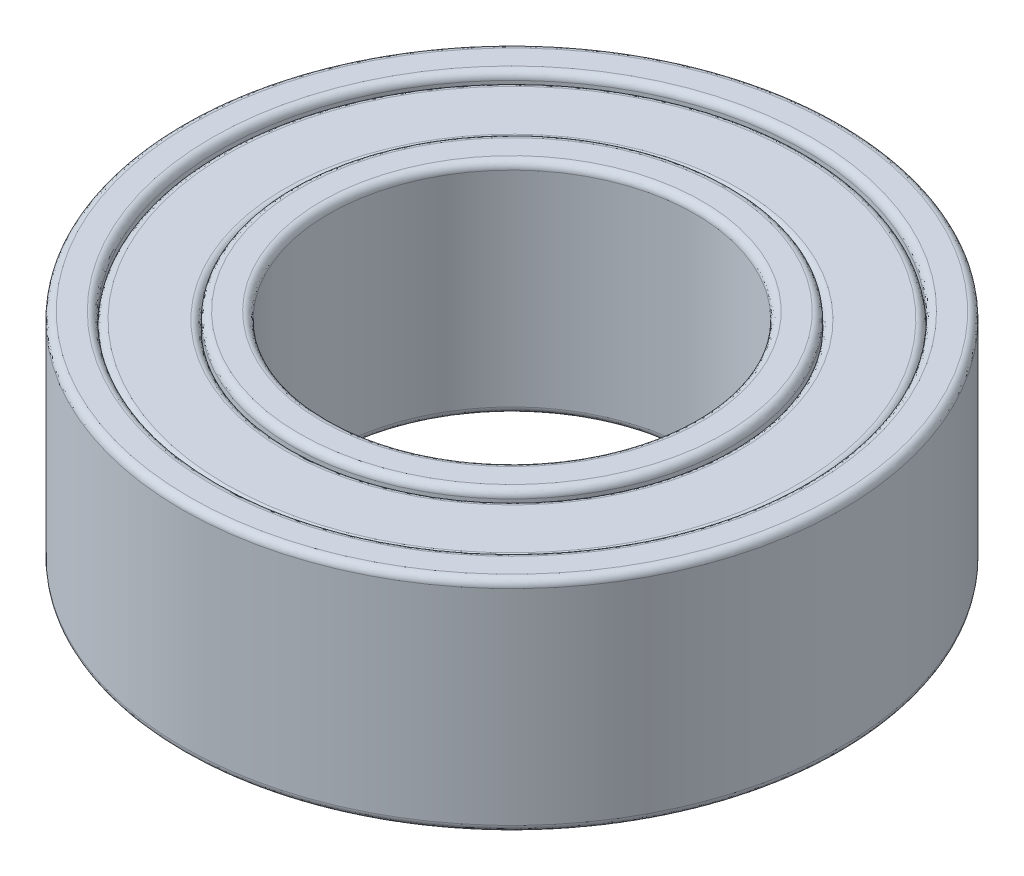
ISO-10303-21;
HEADER;
FILE_DESCRIPTION(('STEP AP214'),'2;1');
FILE_NAME('part.step','',(''),(''),'','','');
FILE_SCHEMA(('AUTOMOTIVE_DESIGN { 1 0 10303 214 1 1 1 1 }'));
ENDSEC;
DATA;
#1=APPLICATION_CONTEXT('core data for automotive mechanical design processes');
#2=APPLICATION_PROTOCOL_DEFINITION('international standard','automotive_design',2000,#1);
#3=PRODUCT_CONTEXT('',#1,'mechanical');
#4=PRODUCT('Part','Part','',(#3));
#5=PRODUCT_RELATED_PRODUCT_CATEGORY('part','',(#4));
#6=PRODUCT_DEFINITION_FORMATION('','',#4);
#7=PRODUCT_DEFINITION_CONTEXT('part definition',#1,'design');
#8=PRODUCT_DEFINITION('design','',#6,#7);
#9=PRODUCT_DEFINITION_SHAPE('','',#8);
#10=(LENGTH_UNIT() NAMED_UNIT(*) SI_UNIT(.MILLI.,.METRE.));
#11=(NAMED_UNIT(*) PLANE_ANGLE_UNIT() SI_UNIT($,.RADIAN.));
#12=(NAMED_UNIT(*) SI_UNIT($,.STERADIAN.) SOLID_ANGLE_UNIT());
#13=UNCERTAINTY_MEASURE_WITH_UNIT(LENGTH_MEASURE(1.E-05),#10,'distance_accuracy_value','');
#14=(GEOMETRIC_REPRESENTATION_CONTEXT(3) GLOBAL_UNCERTAINTY_ASSIGNED_CONTEXT((#13)) GLOBAL_UNIT_ASSIGNED_CONTEXT((#10,
#11,#12)) REPRESENTATION_CONTEXT('',''));
#15=CARTESIAN_POINT('',(0.,0.,0.));
#16=DIRECTION('',(0.,0.,1.));
#17=DIRECTION('',(1.,0.,0.));
#18=AXIS2_PLACEMENT_3D('',#15,#16,#17);
#19=CARTESIAN_POINT('',(0.,2.9,0.));
#20=DIRECTION('',(0.,-1.,0.));
#21=DIRECTION('',(0.,0.,1.));
#22=AXIS2_PLACEMENT_3D('',#19,#20,#21);
#23=CYLINDRICAL_SURFACE('',#22,3.);
#24=DIRECTION('',(0.,-1.,0.));
#25=VECTOR('',#24,1.);
#26=CARTESIAN_POINT('',(0.,2.9,3.));
#27=LINE('',#26,#25);
#28=CARTESIAN_POINT('',(0.,2.9,3.));
#29=VERTEX_POINT('',#28);
#30=CARTESIAN_POINT('',(0.,2.8,3.));
#31=VERTEX_POINT('',#30);
#32=EDGE_CURVE('E11',#29,#31,#27,.T.);
#33=ORIENTED_EDGE('',*,*,#32,.T.);
#34=CARTESIAN_POINT('',(0.,2.8,0.));
#35=DIRECTION('',(0.,1.,0.));
#36=DIRECTION('',(0.,0.,1.));
#37=AXIS2_PLACEMENT_3D('',#34,#35,#36);
#38=CIRCLE('',#37,3.);
#39=EDGE_CURVE('E28',#31,#31,#38,.T.);
#40=ORIENTED_EDGE('',*,*,#39,.T.);
#41=ORIENTED_EDGE('',*,*,#32,.F.);
#42=CARTESIAN_POINT('',(0.,2.9,0.));
#43=DIRECTION('',(0.,1.,0.));
#44=DIRECTION('',(0.,0.,1.));
#45=AXIS2_PLACEMENT_3D('',#42,#43,#44);
#46=CIRCLE('',#45,3.);
#47=EDGE_CURVE('E678',#29,#29,#46,.T.);
#48=ORIENTED_EDGE('',*,*,#47,.F.);
#49=EDGE_LOOP('',(#33,#40,#41,#48));
#50=FACE_BOUND('',#49,.T.);
#51=ADVANCED_FACE('F16',(#50),#23,.T.);
#52=CARTESIAN_POINT('',(0.,2.8,3.));
#53=CARTESIAN_POINT('',(0.,2.85857864376269,3.));
#54=CARTESIAN_POINT('',(0.,2.9,3.04142135623731));
#55=CARTESIAN_POINT('',(0.,2.9,3.1));
#56=(BOUNDED_CURVE() B_SPLINE_CURVE(3,(#52,#53,#54,#55),.UNSPECIFIED.,.F.,
.F.) B_SPLINE_CURVE_WITH_KNOTS((4,4),(0.,1.),
.UNSPECIFIED.) CURVE() GEOMETRIC_REPRESENTATION_ITEM() RATIONAL_B_SPLINE_CURVE((1.,
0.804737854124365,0.804737854124365,1.)) REPRESENTATION_ITEM(''));
#57=CARTESIAN_POINT('',(0.,0.,0.));
#58=DIRECTION('',(0.,-1.,0.));
#59=AXIS1_PLACEMENT('',#57,#58);
#60=SURFACE_OF_REVOLUTION('',#56,#59);
#61=CARTESIAN_POINT('',(0.,2.8,3.1));
#62=DIRECTION('',(1.,0.,0.));
#63=DIRECTION('',(0.,1.,0.));
#64=AXIS2_PLACEMENT_3D('',#61,#62,#63);
#65=CIRCLE('',#64,0.1);
#66=CARTESIAN_POINT('',(0.,2.9,3.1));
#67=VERTEX_POINT('',#66);
#68=EDGE_CURVE('E48',#31,#67,#65,.T.);
#69=ORIENTED_EDGE('',*,*,#68,.T.);
#70=CARTESIAN_POINT('',(0.,2.9,0.));
#71=DIRECTION('',(0.,1.,0.));
#72=DIRECTION('',(0.,0.,1.));
#73=AXIS2_PLACEMENT_3D('',#70,#71,#72);
#74=CIRCLE('',#73,3.1);
#75=EDGE_CURVE('E247',#67,#67,#74,.T.);
#76=ORIENTED_EDGE('',*,*,#75,.T.);
#77=ORIENTED_EDGE('',*,*,#68,.F.);
#78=ORIENTED_EDGE('',*,*,#39,.F.);
#79=EDGE_LOOP('',(#69,#76,#77,#78));
#80=FACE_BOUND('',#79,.T.);
#81=ADVANCED_FACE('F266',(#80),#60,.T.);
#82=CARTESIAN_POINT('',(0.,2.9,0.));
#83=DIRECTION('',(0.,-1.,0.));
#84=DIRECTION('',(-1.,0.,0.));
#85=AXIS2_PLACEMENT_3D('',#82,#83,#84);
#86=PLANE('',#85);
#87=CARTESIAN_POINT('',(0.,2.9,0.));
#88=DIRECTION('',(0.,1.,0.));
#89=DIRECTION('',(0.,0.,1.));
#90=AXIS2_PLACEMENT_3D('',#87,#88,#89);
#91=CIRCLE('',#90,3.9);
#92=CARTESIAN_POINT('',(0.,2.9,3.9));
#93=VERTEX_POINT('',#92);
#94=EDGE_CURVE('E244',#93,#93,#91,.T.);
#95=ORIENTED_EDGE('',*,*,#94,.T.);
#96=EDGE_LOOP('',(#95));
#97=FACE_BOUND('',#96,.T.);
#98=ORIENTED_EDGE('',*,*,#75,.F.);
#99=EDGE_LOOP('',(#98));
#100=FACE_BOUND('',#99,.T.);
#101=ADVANCED_FACE('F270',(#97,#100),#86,.F.);
#102=CARTESIAN_POINT('',(0.,2.9,3.9));
#103=CARTESIAN_POINT('',(0.,2.9,3.95857862527601));
#104=CARTESIAN_POINT('',(0.,2.85857866507801,3.99999997668453));
#105=CARTESIAN_POINT('',(0.,2.800000039802,4.));
#106=(BOUNDED_CURVE() B_SPLINE_CURVE(3,(#102,#103,#104,#105),.UNSPECIFIED.,.F.,
.F.) B_SPLINE_CURVE_WITH_KNOTS((4,4),(0.,1.),
.UNSPECIFIED.) CURVE() GEOMETRIC_REPRESENTATION_ITEM() RATIONAL_B_SPLINE_CURVE((1.,
0.80473794793857,0.80473794793857,1.)) REPRESENTATION_ITEM(''));
#107=CARTESIAN_POINT('',(0.,0.,0.));
#108=DIRECTION('',(0.,-1.,0.));
#109=AXIS1_PLACEMENT('',#107,#108);
#110=SURFACE_OF_REVOLUTION('',#106,#109);
#111=CARTESIAN_POINT('',(0.,2.8,3.9));
#112=DIRECTION('',(1.,0.,0.));
#113=DIRECTION('',(0.,1.,0.));
#114=AXIS2_PLACEMENT_3D('',#111,#112,#113);
#115=CIRCLE('',#114,0.1);
#116=CARTESIAN_POINT('',(0.,2.800000039802,4.));
#117=VERTEX_POINT('',#116);
#118=EDGE_CURVE('E243',#93,#117,#115,.T.);
#119=ORIENTED_EDGE('',*,*,#118,.T.);
#120=CARTESIAN_POINT('',(0.,2.800000039802,0.));
#121=DIRECTION('',(0.,1.,0.));
#122=DIRECTION('',(0.,0.,1.));
#123=AXIS2_PLACEMENT_3D('',#120,#121,#122);
#124=CIRCLE('',#123,4.);
#125=EDGE_CURVE('E169',#117,#117,#124,.T.);
#126=ORIENTED_EDGE('',*,*,#125,.T.);
#127=ORIENTED_EDGE('',*,*,#118,.F.);
#128=ORIENTED_EDGE('',*,*,#94,.F.);
#129=EDGE_LOOP('',(#119,#126,#127,#128));
#130=FACE_BOUND('',#129,.T.);
#131=ADVANCED_FACE('F272',(#130),#110,.T.);
#132=CARTESIAN_POINT('',(0.,2.9,0.));
#133=DIRECTION('',(0.,-1.,0.));
#134=DIRECTION('',(0.,0.,1.));
#135=AXIS2_PLACEMENT_3D('',#132,#133,#134);
#136=CYLINDRICAL_SURFACE('',#135,4.);
#137=CARTESIAN_POINT('',(0.,2.9,0.));
#138=DIRECTION('',(0.,1.,0.));
#139=DIRECTION('',(0.,0.,1.));
#140=AXIS2_PLACEMENT_3D('',#137,#138,#139);
#141=CIRCLE('',#140,4.);
#142=CARTESIAN_POINT('',(0.,2.9,4.));
#143=VERTEX_POINT('',#142);
#144=EDGE_CURVE('E170',#143,#143,#141,.T.);
#145=ORIENTED_EDGE('',*,*,#144,.T.);
#146=DIRECTION('',(0.,-1.,0.));
#147=VECTOR('',#146,1.);
#148=CARTESIAN_POINT('',(0.,2.9,4.));
#149=LINE('',#148,#147);
#150=EDGE_CURVE('E165',#143,#117,#149,.T.);
#151=ORIENTED_EDGE('',*,*,#150,.T.);
#152=ORIENTED_EDGE('',*,*,#125,.F.);
#153=ORIENTED_EDGE('',*,*,#150,.F.);
#154=EDGE_LOOP('',(#145,#151,#152,#153));
#155=FACE_BOUND('',#154,.T.);
#156=ADVANCED_FACE('F275',(#155),#136,.F.);
#157=CARTESIAN_POINT('',(0.,2.9,4.));
#158=CARTESIAN_POINT('',(0.,2.95857864376269,4.));
#159=CARTESIAN_POINT('',(0.,3.,4.04142135623731));
#160=CARTESIAN_POINT('',(0.,3.,4.1));
#161=(BOUNDED_CURVE() B_SPLINE_CURVE(3,(#157,#158,#159,#160),.UNSPECIFIED.,.F.,
.F.) B_SPLINE_CURVE_WITH_KNOTS((4,4),(0.,1.),
.UNSPECIFIED.) CURVE() GEOMETRIC_REPRESENTATION_ITEM() RATIONAL_B_SPLINE_CURVE((1.,
0.804737854124365,0.804737854124365,1.)) REPRESENTATION_ITEM(''));
#162=CARTESIAN_POINT('',(0.,0.,0.));
#163=DIRECTION('',(0.,-1.,0.));
#164=AXIS1_PLACEMENT('',#162,#163);
#165=SURFACE_OF_REVOLUTION('',#161,#164);
#166=CARTESIAN_POINT('',(0.,2.9,4.1));
#167=DIRECTION('',(1.,0.,0.));
#168=DIRECTION('',(0.,1.,0.));
#169=AXIS2_PLACEMENT_3D('',#166,#167,#168);
#170=CIRCLE('',#169,0.1);
#171=CARTESIAN_POINT('',(0.,3.,4.1));
#172=VERTEX_POINT('',#171);
#173=EDGE_CURVE('E225',#143,#172,#170,.T.);
#174=ORIENTED_EDGE('',*,*,#173,.T.);
#175=CARTESIAN_POINT('',(0.,3.,0.));
#176=DIRECTION('',(0.,1.,0.));
#177=DIRECTION('',(0.,0.,1.));
#178=AXIS2_PLACEMENT_3D('',#175,#176,#177);
#179=CIRCLE('',#178,4.1);
#180=EDGE_CURVE('E228',#172,#172,#179,.T.);
#181=ORIENTED_EDGE('',*,*,#180,.T.);
#182=ORIENTED_EDGE('',*,*,#173,.F.);
#183=ORIENTED_EDGE('',*,*,#144,.F.);
#184=EDGE_LOOP('',(#174,#181,#182,#183));
#185=FACE_BOUND('',#184,.T.);
#186=ADVANCED_FACE('F277',(#185),#165,.T.);
#187=CARTESIAN_POINT('',(0.,3.,0.));
#188=DIRECTION('',(0.,1.,0.));
#189=DIRECTION('',(0.,0.,-1.));
#190=AXIS2_PLACEMENT_3D('',#187,#188,#189);
#191=PLANE('',#190);
#192=ORIENTED_EDGE('',*,*,#180,.F.);
#193=EDGE_LOOP('',(#192));
#194=FACE_BOUND('',#193,.T.);
#195=CARTESIAN_POINT('',(0.,3.,0.));
#196=DIRECTION('',(0.,1.,0.));
#197=DIRECTION('',(0.,0.,1.));
#198=AXIS2_PLACEMENT_3D('',#195,#196,#197);
#199=CIRCLE('',#198,4.4);
#200=CARTESIAN_POINT('',(0.,3.,4.4));
#201=VERTEX_POINT('',#200);
#202=EDGE_CURVE('E231',#201,#201,#199,.T.);
#203=ORIENTED_EDGE('',*,*,#202,.T.);
#204=EDGE_LOOP('',(#203));
#205=FACE_BOUND('',#204,.T.);
#206=ADVANCED_FACE('F280',(#194,#205),#191,.T.);
#207=CARTESIAN_POINT('',(0.,3.,4.4));
#208=CARTESIAN_POINT('',(0.,3.,4.45857864376269));
#209=CARTESIAN_POINT('',(0.,2.95857864376269,4.5));
#210=CARTESIAN_POINT('',(0.,2.9,4.5));
#211=(BOUNDED_CURVE() B_SPLINE_CURVE(3,(#207,#208,#209,#210),.UNSPECIFIED.,.F.,
.F.) B_SPLINE_CURVE_WITH_KNOTS((4,4),(0.,1.),
.UNSPECIFIED.) CURVE() GEOMETRIC_REPRESENTATION_ITEM() RATIONAL_B_SPLINE_CURVE((1.,
0.804737854124365,0.804737854124365,1.)) REPRESENTATION_ITEM(''));
#212=CARTESIAN_POINT('',(0.,0.,0.));
#213=DIRECTION('',(0.,-1.,0.));
#214=AXIS1_PLACEMENT('',#212,#213);
#215=SURFACE_OF_REVOLUTION('',#211,#214);
#216=CARTESIAN_POINT('',(0.,2.9,4.4));
#217=DIRECTION('',(1.,0.,0.));
#218=DIRECTION('',(0.,1.,0.));
#219=AXIS2_PLACEMENT_3D('',#216,#217,#218);
#220=CIRCLE('',#219,0.1);
#221=CARTESIAN_POINT('',(0.,2.9,4.5));
#222=VERTEX_POINT('',#221);
#223=EDGE_CURVE('E224',#201,#222,#220,.T.);
#224=ORIENTED_EDGE('',*,*,#223,.T.);
#225=CARTESIAN_POINT('',(0.,2.9,0.));
#226=DIRECTION('',(0.,1.,0.));
#227=DIRECTION('',(0.,0.,1.));
#228=AXIS2_PLACEMENT_3D('',#225,#226,#227);
#229=CIRCLE('',#228,4.5);
#230=EDGE_CURVE('E208',#222,#222,#229,.T.);
#231=ORIENTED_EDGE('',*,*,#230,.T.);
#232=ORIENTED_EDGE('',*,*,#223,.F.);
#233=ORIENTED_EDGE('',*,*,#202,.F.);
#234=EDGE_LOOP('',(#224,#231,#232,#233));
#235=FACE_BOUND('',#234,.T.);
#236=ADVANCED_FACE('F282',(#235),#215,.T.);
#237=CARTESIAN_POINT('',(0.,0.1,0.));
#238=DIRECTION('',(0.,1.,0.));
#239=DIRECTION('',(0.,0.,1.));
#240=AXIS2_PLACEMENT_3D('',#237,#238,#239);
#241=CYLINDRICAL_SURFACE('',#240,4.5);
#242=CARTESIAN_POINT('',(0.,0.1,0.));
#243=DIRECTION('',(0.,1.,0.));
#244=DIRECTION('',(0.,0.,1.));
#245=AXIS2_PLACEMENT_3D('',#242,#243,#244);
#246=CIRCLE('',#245,4.5);
#247=CARTESIAN_POINT('',(0.,0.1,4.5));
#248=VERTEX_POINT('',#247);
#249=EDGE_CURVE('E209',#248,#248,#246,.T.);
#250=ORIENTED_EDGE('',*,*,#249,.T.);
#251=DIRECTION('',(0.,1.,0.));
#252=VECTOR('',#251,1.);
#253=CARTESIAN_POINT('',(0.,0.1,4.5));
#254=LINE('',#253,#252);
#255=EDGE_CURVE('E204',#248,#222,#254,.T.);
#256=ORIENTED_EDGE('',*,*,#255,.T.);
#257=ORIENTED_EDGE('',*,*,#230,.F.);
#258=ORIENTED_EDGE('',*,*,#255,.F.);
#259=EDGE_LOOP('',(#250,#256,#257,#258));
#260=FACE_BOUND('',#259,.T.);
#261=ADVANCED_FACE('F313',(#260),#241,.T.);
#262=CARTESIAN_POINT('',(0.,0.1,4.5));
#263=CARTESIAN_POINT('',(0.,0.0414213562373095,4.5));
#264=CARTESIAN_POINT('',(0.,0.,4.45857864376269));
#265=CARTESIAN_POINT('',(0.,0.,4.4));
#266=(BOUNDED_CURVE() B_SPLINE_CURVE(3,(#262,#263,#264,#265),.UNSPECIFIED.,.F.,
.F.) B_SPLINE_CURVE_WITH_KNOTS((4,4),(0.,1.),
.UNSPECIFIED.) CURVE() GEOMETRIC_REPRESENTATION_ITEM() RATIONAL_B_SPLINE_CURVE((1.,
0.804737854124365,0.804737854124365,1.)) REPRESENTATION_ITEM(''));
#267=CARTESIAN_POINT('',(0.,0.,0.));
#268=DIRECTION('',(0.,-1.,0.));
#269=AXIS1_PLACEMENT('',#267,#268);
#270=SURFACE_OF_REVOLUTION('',#266,#269);
#271=CARTESIAN_POINT('',(0.,0.1,4.4));
#272=DIRECTION('',(1.,0.,0.));
#273=DIRECTION('',(0.,1.,0.));
#274=AXIS2_PLACEMENT_3D('',#271,#272,#273);
#275=CIRCLE('',#274,0.1);
#276=CARTESIAN_POINT('',(0.,0.,4.4));
#277=VERTEX_POINT('',#276);
#278=EDGE_CURVE('E217',#248,#277,#275,.T.);
#279=ORIENTED_EDGE('',*,*,#278,.T.);
#280=CARTESIAN_POINT('',(0.,0.,0.));
#281=DIRECTION('',(0.,1.,0.));
#282=DIRECTION('',(0.,0.,1.));
#283=AXIS2_PLACEMENT_3D('',#280,#281,#282);
#284=CIRCLE('',#283,4.4);
#285=EDGE_CURVE('E213',#277,#277,#284,.T.);
#286=ORIENTED_EDGE('',*,*,#285,.T.);
#287=ORIENTED_EDGE('',*,*,#278,.F.);
#288=ORIENTED_EDGE('',*,*,#249,.F.);
#289=EDGE_LOOP('',(#279,#286,#287,#288));
#290=FACE_BOUND('',#289,.T.);
#291=ADVANCED_FACE('F309',(#290),#270,.T.);
#292=CARTESIAN_POINT('',(0.,0.,0.));
#293=DIRECTION('',(0.,-1.,0.));
#294=DIRECTION('',(-1.,0.,0.));
#295=AXIS2_PLACEMENT_3D('',#292,#293,#294);
#296=PLANE('',#295);
#297=ORIENTED_EDGE('',*,*,#285,.F.);
#298=EDGE_LOOP('',(#297));
#299=FACE_BOUND('',#298,.T.);
#300=CARTESIAN_POINT('',(0.,0.,0.));
#301=DIRECTION('',(0.,1.,0.));
#302=DIRECTION('',(0.,0.,1.));
#303=AXIS2_PLACEMENT_3D('',#300,#301,#302);
#304=CIRCLE('',#303,4.1);
#305=CARTESIAN_POINT('',(0.,0.,4.1));
#306=VERTEX_POINT('',#305);
#307=EDGE_CURVE('E210',#306,#306,#304,.T.);
#308=ORIENTED_EDGE('',*,*,#307,.T.);
#309=EDGE_LOOP('',(#308));
#310=FACE_BOUND('',#309,.T.);
#311=ADVANCED_FACE('F312',(#299,#310),#296,.T.);
#312=CARTESIAN_POINT('',(0.,0.,4.1));
#313=CARTESIAN_POINT('',(0.,0.,4.04142135623731));
#314=CARTESIAN_POINT('',(0.,0.0414213562373095,4.));
#315=CARTESIAN_POINT('',(0.,0.1,4.));
#316=(BOUNDED_CURVE() B_SPLINE_CURVE(3,(#312,#313,#314,#315),.UNSPECIFIED.,.F.,
.F.) B_SPLINE_CURVE_WITH_KNOTS((4,4),(0.,1.),
.UNSPECIFIED.) CURVE() GEOMETRIC_REPRESENTATION_ITEM() RATIONAL_B_SPLINE_CURVE((1.,
0.804737854124365,0.804737854124365,1.)) REPRESENTATION_ITEM(''));
#317=CARTESIAN_POINT('',(0.,0.,0.));
#318=DIRECTION('',(0.,-1.,0.));
#319=AXIS1_PLACEMENT('',#317,#318);
#320=SURFACE_OF_REVOLUTION('',#316,#319);
#321=CARTESIAN_POINT('',(0.,0.1,4.1));
#322=DIRECTION('',(1.,0.,0.));
#323=DIRECTION('',(0.,1.,0.));
#324=AXIS2_PLACEMENT_3D('',#321,#322,#323);
#325=CIRCLE('',#324,0.1);
#326=CARTESIAN_POINT('',(0.,0.1,4.));
#327=VERTEX_POINT('',#326);
#328=EDGE_CURVE('E203',#306,#327,#325,.T.);
#329=ORIENTED_EDGE('',*,*,#328,.T.);
#330=CARTESIAN_POINT('',(0.,0.1,0.));
#331=DIRECTION('',(0.,1.,0.));
#332=DIRECTION('',(0.,0.,1.));
#333=AXIS2_PLACEMENT_3D('',#330,#331,#332);
#334=CIRCLE('',#333,4.);
#335=EDGE_CURVE('E199',#327,#327,#334,.T.);
#336=ORIENTED_EDGE('',*,*,#335,.T.);
#337=ORIENTED_EDGE('',*,*,#328,.F.);
#338=ORIENTED_EDGE('',*,*,#307,.F.);
#339=EDGE_LOOP('',(#329,#336,#337,#338));
#340=FACE_BOUND('',#339,.T.);
#341=ADVANCED_FACE('F315',(#340),#320,.T.);
#342=CARTESIAN_POINT('',(0.,0.1,0.));
#343=DIRECTION('',(0.,1.,0.));
#344=DIRECTION('',(0.,0.,1.));
#345=AXIS2_PLACEMENT_3D('',#342,#343,#344);
#346=CYLINDRICAL_SURFACE('',#345,4.);
#347=DIRECTION('',(0.,1.,0.));
#348=VECTOR('',#347,1.);
#349=CARTESIAN_POINT('',(0.,0.1,4.));
#350=LINE('',#349,#348);
#351=CARTESIAN_POINT('',(0.,0.2,4.));
#352=VERTEX_POINT('',#351);
#353=EDGE_CURVE('E196',#327,#352,#350,.T.);
#354=ORIENTED_EDGE('',*,*,#353,.T.);
#355=CARTESIAN_POINT('',(0.,0.2,0.));
#356=DIRECTION('',(0.,1.,0.));
#357=DIRECTION('',(0.,0.,1.));
#358=AXIS2_PLACEMENT_3D('',#355,#356,#357);
#359=CIRCLE('',#358,4.);
#360=EDGE_CURVE('E192',#352,#352,#359,.T.);
#361=ORIENTED_EDGE('',*,*,#360,.T.);
#362=ORIENTED_EDGE('',*,*,#353,.F.);
#363=ORIENTED_EDGE('',*,*,#335,.F.);
#364=EDGE_LOOP('',(#354,#361,#362,#363));
#365=FACE_BOUND('',#364,.T.);
#366=ADVANCED_FACE('F318',(#365),#346,.F.);
#367=CARTESIAN_POINT('',(0.,0.2,4.));
#368=CARTESIAN_POINT('',(0.,0.14142135623731,4.));
#369=CARTESIAN_POINT('',(0.,0.1,3.95857864376269));
#370=CARTESIAN_POINT('',(0.,0.1,3.9));
#371=(BOUNDED_CURVE() B_SPLINE_CURVE(3,(#367,#368,#369,#370),.UNSPECIFIED.,.F.,
.F.) B_SPLINE_CURVE_WITH_KNOTS((4,4),(0.,1.),
.UNSPECIFIED.) CURVE() GEOMETRIC_REPRESENTATION_ITEM() RATIONAL_B_SPLINE_CURVE((1.,
0.804737854124365,0.804737854124365,1.)) REPRESENTATION_ITEM(''));
#372=CARTESIAN_POINT('',(0.,0.,0.));
#373=DIRECTION('',(0.,-1.,0.));
#374=AXIS1_PLACEMENT('',#372,#373);
#375=SURFACE_OF_REVOLUTION('',#371,#374);
#376=CARTESIAN_POINT('',(0.,0.2,3.9));
#377=DIRECTION('',(1.,0.,0.));
#378=DIRECTION('',(0.,1.,0.));
#379=AXIS2_PLACEMENT_3D('',#376,#377,#378);
#380=CIRCLE('',#379,0.1);
#381=CARTESIAN_POINT('',(0.,0.1,3.9));
#382=VERTEX_POINT('',#381);
#383=EDGE_CURVE('E189',#352,#382,#380,.T.);
#384=ORIENTED_EDGE('',*,*,#383,.T.);
#385=CARTESIAN_POINT('',(0.,0.1,0.));
#386=DIRECTION('',(0.,1.,0.));
#387=DIRECTION('',(0.,0.,1.));
#388=AXIS2_PLACEMENT_3D('',#385,#386,#387);
#389=CIRCLE('',#388,3.9);
#390=EDGE_CURVE('E185',#382,#382,#389,.T.);
#391=ORIENTED_EDGE('',*,*,#390,.T.);
#392=ORIENTED_EDGE('',*,*,#383,.F.);
#393=ORIENTED_EDGE('',*,*,#360,.F.);
#394=EDGE_LOOP('',(#384,#391,#392,#393));
#395=FACE_BOUND('',#394,.T.);
#396=ADVANCED_FACE('F320',(#395),#375,.T.);
#397=CARTESIAN_POINT('',(0.,0.1,0.));
#398=DIRECTION('',(0.,1.,0.));
#399=DIRECTION('',(0.,0.,-1.));
#400=AXIS2_PLACEMENT_3D('',#397,#398,#399);
#401=PLANE('',#400);
#402=CARTESIAN_POINT('',(0.,0.1,0.));
#403=DIRECTION('',(0.,1.,0.));
#404=DIRECTION('',(0.,0.,1.));
#405=AXIS2_PLACEMENT_3D('',#402,#403,#404);
#406=CIRCLE('',#405,3.1);
#407=CARTESIAN_POINT('',(0.,0.1,3.1));
#408=VERTEX_POINT('',#407);
#409=EDGE_CURVE('E182',#408,#408,#406,.T.);
#410=ORIENTED_EDGE('',*,*,#409,.T.);
#411=EDGE_LOOP('',(#410));
#412=FACE_BOUND('',#411,.T.);
#413=ORIENTED_EDGE('',*,*,#390,.F.);
#414=EDGE_LOOP('',(#413));
#415=FACE_BOUND('',#414,.T.);
#416=ADVANCED_FACE('F323',(#412,#415),#401,.F.);
#417=CARTESIAN_POINT('',(0.,0.1,3.1));
#418=CARTESIAN_POINT('',(0.,0.1,3.04142135623731));
#419=CARTESIAN_POINT('',(0.,0.14142135623731,3.));
#420=CARTESIAN_POINT('',(0.,0.2,3.));
#421=(BOUNDED_CURVE() B_SPLINE_CURVE(3,(#417,#418,#419,#420),.UNSPECIFIED.,.F.,
.F.) B_SPLINE_CURVE_WITH_KNOTS((4,4),(0.,1.),
.UNSPECIFIED.) CURVE() GEOMETRIC_REPRESENTATION_ITEM() RATIONAL_B_SPLINE_CURVE((1.,
0.804737854124365,0.804737854124365,1.)) REPRESENTATION_ITEM(''));
#422=CARTESIAN_POINT('',(0.,0.,0.));
#423=DIRECTION('',(0.,-1.,0.));
#424=AXIS1_PLACEMENT('',#422,#423);
#425=SURFACE_OF_REVOLUTION('',#421,#424);
#426=CARTESIAN_POINT('',(0.,0.2,3.1));
#427=DIRECTION('',(1.,0.,0.));
#428=DIRECTION('',(0.,1.,0.));
#429=AXIS2_PLACEMENT_3D('',#426,#427,#428);
#430=CIRCLE('',#429,0.1);
#431=CARTESIAN_POINT('',(0.,0.2,3.));
#432=VERTEX_POINT('',#431);
#433=EDGE_CURVE('E163',#408,#432,#430,.T.);
#434=ORIENTED_EDGE('',*,*,#433,.T.);
#435=CARTESIAN_POINT('',(0.,0.2,0.));
#436=DIRECTION('',(0.,1.,0.));
#437=DIRECTION('',(0.,0.,1.));
#438=AXIS2_PLACEMENT_3D('',#435,#436,#437);
#439=CIRCLE('',#438,3.);
#440=EDGE_CURVE('E159',#432,#432,#439,.T.);
#441=ORIENTED_EDGE('',*,*,#440,.T.);
#442=ORIENTED_EDGE('',*,*,#433,.F.);
#443=ORIENTED_EDGE('',*,*,#409,.F.);
#444=EDGE_LOOP('',(#434,#441,#442,#443));
#445=FACE_BOUND('',#444,.T.);
#446=ADVANCED_FACE('F325',(#445),#425,.T.);
#447=CARTESIAN_POINT('',(0.,0.1,0.));
#448=DIRECTION('',(0.,1.,0.));
#449=DIRECTION('',(0.,0.,1.));
#450=AXIS2_PLACEMENT_3D('',#447,#448,#449);
#451=CYLINDRICAL_SURFACE('',#450,3.);
#452=CARTESIAN_POINT('',(0.,0.1,0.));
#453=DIRECTION('',(0.,1.,0.));
#454=DIRECTION('',(0.,0.,1.));
#455=AXIS2_PLACEMENT_3D('',#452,#453,#454);
#456=CIRCLE('',#455,3.);
#457=CARTESIAN_POINT('',(0.,0.1,3.));
#458=VERTEX_POINT('',#457);
#459=EDGE_CURVE('E181',#458,#458,#456,.T.);
#460=ORIENTED_EDGE('',*,*,#459,.T.);
#461=DIRECTION('',(0.,1.,0.));
#462=VECTOR('',#461,1.);
#463=CARTESIAN_POINT('',(0.,0.1,3.));
#464=LINE('',#463,#462);
#465=EDGE_CURVE('E164',#458,#432,#464,.T.);
#466=ORIENTED_EDGE('',*,*,#465,.T.);
#467=ORIENTED_EDGE('',*,*,#440,.F.);
#468=ORIENTED_EDGE('',*,*,#465,.F.);
#469=EDGE_LOOP('',(#460,#466,#467,#468));
#470=FACE_BOUND('',#469,.T.);
#471=ADVANCED_FACE('F355',(#470),#451,.T.);
#472=CARTESIAN_POINT('',(0.,0.1,3.));
#473=CARTESIAN_POINT('',(0.,0.0414213562373095,3.));
#474=CARTESIAN_POINT('',(0.,0.,2.95857864376269));
#475=CARTESIAN_POINT('',(0.,0.,2.9));
#476=(BOUNDED_CURVE() B_SPLINE_CURVE(3,(#472,#473,#474,#475),.UNSPECIFIED.,.F.,
.F.) B_SPLINE_CURVE_WITH_KNOTS((4,4),(0.,1.),
.UNSPECIFIED.) CURVE() GEOMETRIC_REPRESENTATION_ITEM() RATIONAL_B_SPLINE_CURVE((1.,
0.804737854124365,0.804737854124365,1.)) REPRESENTATION_ITEM(''));
#477=CARTESIAN_POINT('',(0.,0.,0.));
#478=DIRECTION('',(0.,-1.,0.));
#479=AXIS1_PLACEMENT('',#477,#478);
#480=SURFACE_OF_REVOLUTION('',#476,#479);
#481=CARTESIAN_POINT('',(0.,0.1,2.9));
#482=DIRECTION('',(1.,0.,0.));
#483=DIRECTION('',(0.,1.,0.));
#484=AXIS2_PLACEMENT_3D('',#481,#482,#483);
#485=CIRCLE('',#484,0.1);
#486=CARTESIAN_POINT('',(0.,0.,2.9));
#487=VERTEX_POINT('',#486);
#488=EDGE_CURVE('E178',#458,#487,#485,.T.);
#489=ORIENTED_EDGE('',*,*,#488,.T.);
#490=CARTESIAN_POINT('',(0.,0.,0.));
#491=DIRECTION('',(0.,1.,0.));
#492=DIRECTION('',(0.,0.,1.));
#493=AXIS2_PLACEMENT_3D('',#490,#491,#492);
#494=CIRCLE('',#493,2.9);
#495=EDGE_CURVE('E174',#487,#487,#494,.T.);
#496=ORIENTED_EDGE('',*,*,#495,.T.);
#497=ORIENTED_EDGE('',*,*,#488,.F.);
#498=ORIENTED_EDGE('',*,*,#459,.F.);
#499=EDGE_LOOP('',(#489,#496,#497,#498));
#500=FACE_BOUND('',#499,.T.);
#501=ADVANCED_FACE('F351',(#500),#480,.T.);
#502=CARTESIAN_POINT('',(0.,0.,0.));
#503=DIRECTION('',(0.,-1.,0.));
#504=DIRECTION('',(-1.,0.,0.));
#505=AXIS2_PLACEMENT_3D('',#502,#503,#504);
#506=PLANE('',#505);
#507=ORIENTED_EDGE('',*,*,#495,.F.);
#508=EDGE_LOOP('',(#507));
#509=FACE_BOUND('',#508,.T.);
#510=CARTESIAN_POINT('',(0.,0.,0.));
#511=DIRECTION('',(0.,1.,0.));
#512=DIRECTION('',(0.,0.,1.));
#513=AXIS2_PLACEMENT_3D('',#510,#511,#512);
#514=CIRCLE('',#513,2.6);
#515=CARTESIAN_POINT('',(0.,0.,2.6));
#516=VERTEX_POINT('',#515);
#517=EDGE_CURVE('E171',#516,#516,#514,.T.);
#518=ORIENTED_EDGE('',*,*,#517,.T.);
#519=EDGE_LOOP('',(#518));
#520=FACE_BOUND('',#519,.T.);
#521=ADVANCED_FACE('F354',(#509,#520),#506,.T.);
#522=CARTESIAN_POINT('',(0.,0.,2.6));
#523=CARTESIAN_POINT('',(0.,0.,2.54142135623731));
#524=CARTESIAN_POINT('',(0.,0.0414213562373095,2.5));
#525=CARTESIAN_POINT('',(0.,0.1,2.5));
#526=(BOUNDED_CURVE() B_SPLINE_CURVE(3,(#522,#523,#524,#525),.UNSPECIFIED.,.F.,
.F.) B_SPLINE_CURVE_WITH_KNOTS((4,4),(0.,1.),
.UNSPECIFIED.) CURVE() GEOMETRIC_REPRESENTATION_ITEM() RATIONAL_B_SPLINE_CURVE((1.,
0.804737854124365,0.804737854124365,1.)) REPRESENTATION_ITEM(''));
#527=CARTESIAN_POINT('',(0.,0.,0.));
#528=DIRECTION('',(0.,-1.,0.));
#529=AXIS1_PLACEMENT('',#527,#528);
#530=SURFACE_OF_REVOLUTION('',#526,#529);
#531=CARTESIAN_POINT('',(0.,0.1,2.6));
#532=DIRECTION('',(1.,0.,0.));
#533=DIRECTION('',(0.,1.,0.));
#534=AXIS2_PLACEMENT_3D('',#531,#532,#533);
#535=CIRCLE('',#534,0.1);
#536=CARTESIAN_POINT('',(0.,0.1,2.5));
#537=VERTEX_POINT('',#536);
#538=EDGE_CURVE('E153',#516,#537,#535,.T.);
#539=ORIENTED_EDGE('',*,*,#538,.T.);
#540=CARTESIAN_POINT('',(0.,0.1,0.));
#541=DIRECTION('',(0.,1.,0.));
#542=DIRECTION('',(0.,0.,1.));
#543=AXIS2_PLACEMENT_3D('',#540,#541,#542);
#544=CIRCLE('',#543,2.5);
#545=EDGE_CURVE('E145',#537,#537,#544,.T.);
#546=ORIENTED_EDGE('',*,*,#545,.T.);
#547=ORIENTED_EDGE('',*,*,#538,.F.);
#548=ORIENTED_EDGE('',*,*,#517,.F.);
#549=EDGE_LOOP('',(#539,#546,#547,#548));
#550=FACE_BOUND('',#549,.T.);
#551=ADVANCED_FACE('F357',(#550),#530,.T.);
#552=CARTESIAN_POINT('',(0.,2.9,0.));
#553=DIRECTION('',(0.,-1.,0.));
#554=DIRECTION('',(0.,0.,1.));
#555=AXIS2_PLACEMENT_3D('',#552,#553,#554);
#556=CYLINDRICAL_SURFACE('',#555,2.5);
#557=CARTESIAN_POINT('',(0.,2.9,0.));
#558=DIRECTION('',(0.,1.,0.));
#559=DIRECTION('',(0.,0.,1.));
#560=AXIS2_PLACEMENT_3D('',#557,#558,#559);
#561=CIRCLE('',#560,2.5);
#562=CARTESIAN_POINT('',(0.,2.9,2.5));
#563=VERTEX_POINT('',#562);
#564=EDGE_CURVE('E143',#563,#563,#561,.T.);
#565=ORIENTED_EDGE('',*,*,#564,.T.);
#566=DIRECTION('',(0.,-1.,0.));
#567=VECTOR('',#566,1.);
#568=CARTESIAN_POINT('',(0.,2.9,2.5));
#569=LINE('',#568,#567);
#570=EDGE_CURVE('E140',#563,#537,#569,.T.);
#571=ORIENTED_EDGE('',*,*,#570,.T.);
#572=ORIENTED_EDGE('',*,*,#545,.F.);
#573=ORIENTED_EDGE('',*,*,#570,.F.);
#574=EDGE_LOOP('',(#565,#571,#572,#573));
#575=FACE_BOUND('',#574,.T.);
#576=ADVANCED_FACE('F141',(#575),#556,.F.);
#577=CARTESIAN_POINT('',(0.,2.9,2.5));
#578=CARTESIAN_POINT('',(0.,2.95857864376269,2.5));
#579=CARTESIAN_POINT('',(0.,3.,2.54142135623731));
#580=CARTESIAN_POINT('',(0.,3.,2.6));
#581=(BOUNDED_CURVE() B_SPLINE_CURVE(3,(#577,#578,#579,#580),.UNSPECIFIED.,.F.,
.F.) B_SPLINE_CURVE_WITH_KNOTS((4,4),(0.,1.),
.UNSPECIFIED.) CURVE() GEOMETRIC_REPRESENTATION_ITEM() RATIONAL_B_SPLINE_CURVE((1.,
0.804737854124365,0.804737854124365,1.)) REPRESENTATION_ITEM(''));
#582=CARTESIAN_POINT('',(0.,0.,0.));
#583=DIRECTION('',(0.,-1.,0.));
#584=AXIS1_PLACEMENT('',#582,#583);
#585=SURFACE_OF_REVOLUTION('',#581,#584);
#586=CARTESIAN_POINT('',(0.,2.9,2.6));
#587=DIRECTION('',(1.,0.,0.));
#588=DIRECTION('',(0.,1.,0.));
#589=AXIS2_PLACEMENT_3D('',#586,#587,#588);
#590=CIRCLE('',#589,0.1);
#591=CARTESIAN_POINT('',(0.,3.,2.6));
#592=VERTEX_POINT('',#591);
#593=EDGE_CURVE('E155',#563,#592,#590,.T.);
#594=ORIENTED_EDGE('',*,*,#593,.T.);
#595=CARTESIAN_POINT('',(0.,3.,0.));
#596=DIRECTION('',(0.,1.,0.));
#597=DIRECTION('',(0.,0.,1.));
#598=AXIS2_PLACEMENT_3D('',#595,#596,#597);
#599=CIRCLE('',#598,2.6);
#600=EDGE_CURVE('E684',#592,#592,#599,.T.);
#601=ORIENTED_EDGE('',*,*,#600,.T.);
#602=ORIENTED_EDGE('',*,*,#593,.F.);
#603=ORIENTED_EDGE('',*,*,#564,.F.);
#604=EDGE_LOOP('',(#594,#601,#602,#603));
#605=FACE_BOUND('',#604,.T.);
#606=ADVANCED_FACE('F360',(#605),#585,.T.);
#607=CARTESIAN_POINT('',(0.,3.,0.));
#608=DIRECTION('',(0.,1.,0.));
#609=DIRECTION('',(0.,0.,-1.));
#610=AXIS2_PLACEMENT_3D('',#607,#608,#609);
#611=PLANE('',#610);
#612=ORIENTED_EDGE('',*,*,#600,.F.);
#613=EDGE_LOOP('',(#612));
#614=FACE_BOUND('',#613,.T.);
#615=CARTESIAN_POINT('',(0.,3.,0.));
#616=DIRECTION('',(0.,1.,0.));
#617=DIRECTION('',(0.,0.,1.));
#618=AXIS2_PLACEMENT_3D('',#615,#616,#617);
#619=CIRCLE('',#618,2.9);
#620=CARTESIAN_POINT('',(0.,3.,2.9));
#621=VERTEX_POINT('',#620);
#622=EDGE_CURVE('E692',#621,#621,#619,.T.);
#623=ORIENTED_EDGE('',*,*,#622,.T.);
#624=EDGE_LOOP('',(#623));
#625=FACE_BOUND('',#624,.T.);
#626=ADVANCED_FACE('F362',(#614,#625),#611,.T.);
#627=CARTESIAN_POINT('',(0.,3.,2.9));
#628=CARTESIAN_POINT('',(0.,3.,2.95857864376269));
#629=CARTESIAN_POINT('',(0.,2.95857864376269,3.));
#630=CARTESIAN_POINT('',(0.,2.9,3.));
#631=(BOUNDED_CURVE() B_SPLINE_CURVE(3,(#627,#628,#629,#630),.UNSPECIFIED.,.F.,
.F.) B_SPLINE_CURVE_WITH_KNOTS((4,4),(0.,1.),
.UNSPECIFIED.) CURVE() GEOMETRIC_REPRESENTATION_ITEM() RATIONAL_B_SPLINE_CURVE((1.,
0.804737854124365,0.804737854124365,1.)) REPRESENTATION_ITEM(''));
#632=CARTESIAN_POINT('',(0.,0.,0.));
#633=DIRECTION('',(0.,-1.,0.));
#634=AXIS1_PLACEMENT('',#632,#633);
#635=SURFACE_OF_REVOLUTION('',#631,#634);
#636=CARTESIAN_POINT('',(0.,2.9,2.9));
#637=DIRECTION('',(1.,0.,0.));
#638=DIRECTION('',(0.,1.,0.));
#639=AXIS2_PLACEMENT_3D('',#636,#637,#638);
#640=CIRCLE('',#639,0.1);
#641=EDGE_CURVE('E674',#621,#29,#640,.T.);
#642=ORIENTED_EDGE('',*,*,#641,.T.);
#643=ORIENTED_EDGE('',*,*,#47,.T.);
#644=ORIENTED_EDGE('',*,*,#641,.F.);
#645=ORIENTED_EDGE('',*,*,#622,.F.);
#646=EDGE_LOOP('',(#642,#643,#644,#645));
#647=FACE_BOUND('',#646,.T.);
#648=ADVANCED_FACE('F18',(#647),#635,.T.);
#649=CLOSED_SHELL('',(#51,#81,#101,#131,#156,#186,#206,#236,#261,#291,#311,#341,#366,#396,#416,
#446,#471,#501,#521,#551,#576,#606,#626,#648));
#650=MANIFOLD_SOLID_BREP('B1',#649);
#651=ADVANCED_BREP_SHAPE_REPRESENTATION('',(#18,#650),#14);
#652=SHAPE_DEFINITION_REPRESENTATION(#9,#651);
ENDSEC;
END-ISO-10303-21;
